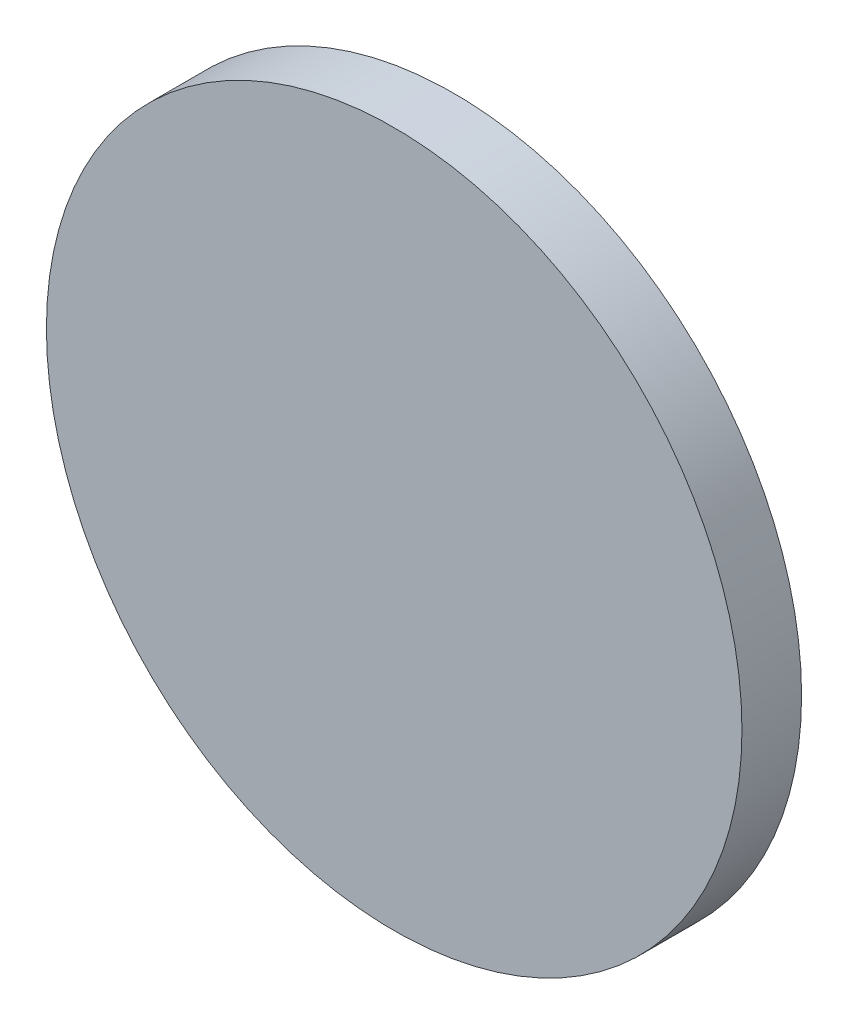
ISO-10303-21;
HEADER;
FILE_DESCRIPTION(('STEP AP214'),'2;1');
FILE_NAME('part.step','',(''),(''),'','','');
FILE_SCHEMA(('AUTOMOTIVE_DESIGN { 1 0 10303 214 1 1 1 1 }'));
ENDSEC;
DATA;
#1=APPLICATION_CONTEXT('core data for automotive mechanical design processes');
#2=APPLICATION_PROTOCOL_DEFINITION('international standard','automotive_design',2000,#1);
#3=PRODUCT_CONTEXT('',#1,'mechanical');
#4=PRODUCT('Part','Part','',(#3));
#5=PRODUCT_RELATED_PRODUCT_CATEGORY('part','',(#4));
#6=PRODUCT_DEFINITION_FORMATION('','',#4);
#7=PRODUCT_DEFINITION_CONTEXT('part definition',#1,'design');
#8=PRODUCT_DEFINITION('design','',#6,#7);
#9=PRODUCT_DEFINITION_SHAPE('','',#8);
#10=(LENGTH_UNIT() NAMED_UNIT(*) SI_UNIT(.MILLI.,.METRE.));
#11=(NAMED_UNIT(*) PLANE_ANGLE_UNIT() SI_UNIT($,.RADIAN.));
#12=(NAMED_UNIT(*) SI_UNIT($,.STERADIAN.) SOLID_ANGLE_UNIT());
#13=UNCERTAINTY_MEASURE_WITH_UNIT(LENGTH_MEASURE(1.E-05),#10,'distance_accuracy_value','');
#14=(GEOMETRIC_REPRESENTATION_CONTEXT(3) GLOBAL_UNCERTAINTY_ASSIGNED_CONTEXT((#13)) GLOBAL_UNIT_ASSIGNED_CONTEXT((#10,
#11,#12)) REPRESENTATION_CONTEXT('',''));
#15=CARTESIAN_POINT('',(0.,0.,0.));
#16=DIRECTION('',(0.,0.,1.));
#17=DIRECTION('',(1.,0.,0.));
#18=AXIS2_PLACEMENT_3D('',#15,#16,#17);
#19=CARTESIAN_POINT('',(11.3665,5.175250014875,0.));
#20=DIRECTION('',(0.,0.,-1.));
#21=DIRECTION('',(-1.,0.,0.));
#22=AXIS2_PLACEMENT_3D('',#19,#20,#21);
#23=PLANE('',#22);
#24=CARTESIAN_POINT('',(11.3665,5.175250014875,0.));
#25=DIRECTION('',(0.,0.,1.));
#26=DIRECTION('',(1.,0.,0.));
#27=AXIS2_PLACEMENT_3D('',#24,#25,#26);
#28=CIRCLE('',#27,0.200024667);
#29=CARTESIAN_POINT('',(11.566524667,5.175250014875,0.));
#30=VERTEX_POINT('',#29);
#31=EDGE_CURVE('E18',#30,#30,#28,.T.);
#32=ORIENTED_EDGE('',*,*,#31,.F.);
#33=EDGE_LOOP('',(#32));
#34=FACE_BOUND('',#33,.T.);
#35=ADVANCED_FACE('F15',(#34),#23,.T.);
#36=CARTESIAN_POINT('',(11.3665,5.175250014875,0.));
#37=DIRECTION('',(0.,0.,1.));
#38=DIRECTION('',(1.,0.,0.));
#39=AXIS2_PLACEMENT_3D('',#36,#37,#38);
#40=CYLINDRICAL_SURFACE('',#39,0.200024667);
#41=CARTESIAN_POINT('',(11.3665,5.175250014875,0.03429));
#42=DIRECTION('',(0.,0.,1.));
#43=DIRECTION('',(1.,0.,0.));
#44=AXIS2_PLACEMENT_3D('',#41,#42,#43);
#45=CIRCLE('',#44,0.200024667);
#46=CARTESIAN_POINT('',(11.566524667,5.175250014875,0.03429));
#47=VERTEX_POINT('',#46);
#48=EDGE_CURVE('E10',#47,#47,#45,.T.);
#49=ORIENTED_EDGE('',*,*,#48,.F.);
#50=EDGE_LOOP('',(#49));
#51=FACE_BOUND('',#50,.T.);
#52=ORIENTED_EDGE('',*,*,#31,.T.);
#53=EDGE_LOOP('',(#52));
#54=FACE_BOUND('',#53,.T.);
#55=ADVANCED_FACE('F27',(#51,#54),#40,.T.);
#56=CARTESIAN_POINT('',(11.3665,5.175250014875,0.03429));
#57=DIRECTION('',(0.,0.,1.));
#58=DIRECTION('',(1.,0.,0.));
#59=AXIS2_PLACEMENT_3D('',#56,#57,#58);
#60=PLANE('',#59);
#61=ORIENTED_EDGE('',*,*,#48,.T.);
#62=EDGE_LOOP('',(#61));
#63=FACE_BOUND('',#62,.T.);
#64=ADVANCED_FACE('F34',(#63),#60,.T.);
#65=CLOSED_SHELL('',(#35,#55,#64));
#66=MANIFOLD_SOLID_BREP('B1',#65);
#67=ADVANCED_BREP_SHAPE_REPRESENTATION('',(#18,#66),#14);
#68=SHAPE_DEFINITION_REPRESENTATION(#9,#67);
ENDSEC;
END-ISO-10303-21;
